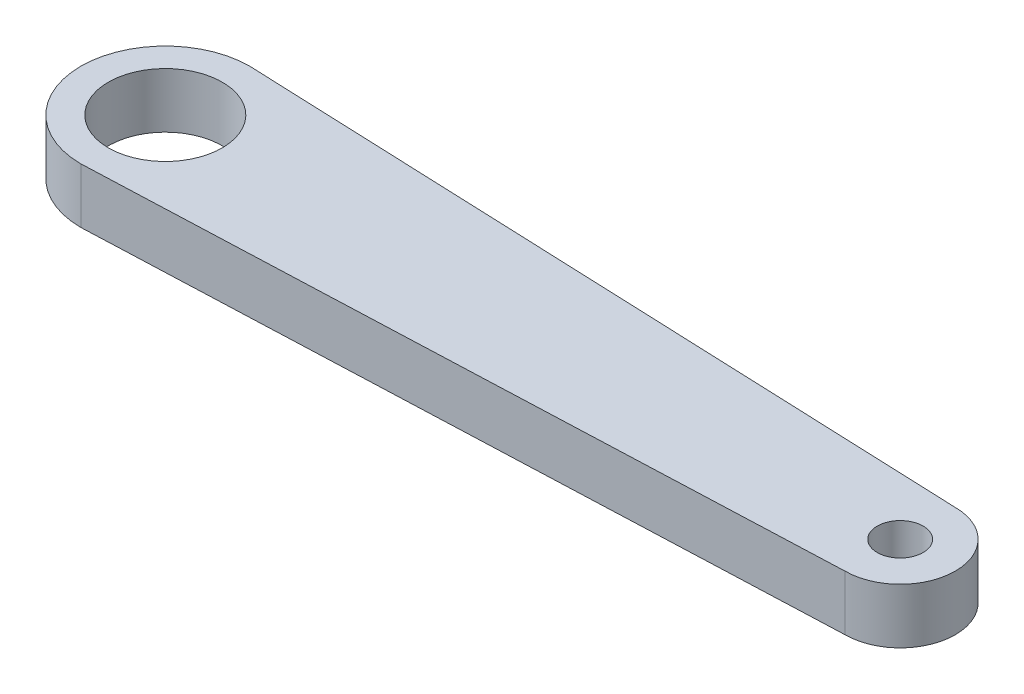
ISO-10303-21;
HEADER;
FILE_DESCRIPTION(('STEP AP214'),'2;1');
FILE_NAME('part.step','',(''),(''),'','','');
FILE_SCHEMA(('AUTOMOTIVE_DESIGN { 1 0 10303 214 1 1 1 1 }'));
ENDSEC;
DATA;
#1=APPLICATION_CONTEXT('core data for automotive mechanical design processes');
#2=APPLICATION_PROTOCOL_DEFINITION('international standard','automotive_design',2000,#1);
#3=PRODUCT_CONTEXT('',#1,'mechanical');
#4=PRODUCT('Part','Part','',(#3));
#5=PRODUCT_RELATED_PRODUCT_CATEGORY('part','',(#4));
#6=PRODUCT_DEFINITION_FORMATION('','',#4);
#7=PRODUCT_DEFINITION_CONTEXT('part definition',#1,'design');
#8=PRODUCT_DEFINITION('design','',#6,#7);
#9=PRODUCT_DEFINITION_SHAPE('','',#8);
#10=(LENGTH_UNIT() NAMED_UNIT(*) SI_UNIT(.MILLI.,.METRE.));
#11=(NAMED_UNIT(*) PLANE_ANGLE_UNIT() SI_UNIT($,.RADIAN.));
#12=(NAMED_UNIT(*) SI_UNIT($,.STERADIAN.) SOLID_ANGLE_UNIT());
#13=UNCERTAINTY_MEASURE_WITH_UNIT(LENGTH_MEASURE(1.E-05),#10,'distance_accuracy_value','');
#14=(GEOMETRIC_REPRESENTATION_CONTEXT(3) GLOBAL_UNCERTAINTY_ASSIGNED_CONTEXT((#13)) GLOBAL_UNIT_ASSIGNED_CONTEXT((#10,
#11,#12)) REPRESENTATION_CONTEXT('',''));
#15=CARTESIAN_POINT('',(0.,0.,0.));
#16=DIRECTION('',(0.,0.,1.));
#17=DIRECTION('',(1.,0.,0.));
#18=AXIS2_PLACEMENT_3D('',#15,#16,#17);
#19=CARTESIAN_POINT('',(0.18370607028754,3.,4.5926517571885));
#20=DIRECTION('',(0.0399680383488716,0.,0.999200958721789));
#21=DIRECTION('',(0.99920095872179,0.,-0.0399680383488716));
#22=AXIS2_PLACEMENT_3D('',#19,#20,#21);
#23=PLANE('',#22);
#24=DIRECTION('',(-0.99920095872179,0.,0.0399680383488716));
#25=VECTOR('',#24,1.);
#26=CARTESIAN_POINT('',(0.18370607028754,0.,4.5926517571885));
#27=LINE('',#26,#25);
#28=CARTESIAN_POINT('',(40.,0.,3.));
#29=VERTEX_POINT('',#28);
#30=CARTESIAN_POINT('',(0.,0.,4.6));
#31=VERTEX_POINT('',#30);
#32=EDGE_CURVE('E122',#29,#31,#27,.T.);
#33=ORIENTED_EDGE('',*,*,#32,.F.);
#34=DIRECTION('',(0.,-1.,0.));
#35=VECTOR('',#34,1.);
#36=CARTESIAN_POINT('',(40.,3.,3.));
#37=LINE('',#36,#35);
#38=CARTESIAN_POINT('',(40.,3.,3.));
#39=VERTEX_POINT('',#38);
#40=EDGE_CURVE('E11',#39,#29,#37,.T.);
#41=ORIENTED_EDGE('',*,*,#40,.F.);
#42=DIRECTION('',(-0.99920095872179,0.,0.0399680383488716));
#43=VECTOR('',#42,1.);
#44=CARTESIAN_POINT('',(0.18370607028754,3.,4.5926517571885));
#45=LINE('',#44,#43);
#46=CARTESIAN_POINT('',(0.,3.,4.6));
#47=VERTEX_POINT('',#46);
#48=EDGE_CURVE('E95',#39,#47,#45,.T.);
#49=ORIENTED_EDGE('',*,*,#48,.T.);
#50=DIRECTION('',(0.,-1.,0.));
#51=VECTOR('',#50,1.);
#52=CARTESIAN_POINT('',(0.,3.,4.6));
#53=LINE('',#52,#51);
#54=EDGE_CURVE('E84',#47,#31,#53,.T.);
#55=ORIENTED_EDGE('',*,*,#54,.T.);
#56=EDGE_LOOP('',(#33,#41,#49,#55));
#57=FACE_BOUND('',#56,.T.);
#58=ADVANCED_FACE('F45',(#57),#23,.T.);
#59=CARTESIAN_POINT('',(40.,3.,0.));
#60=DIRECTION('',(0.,-1.,0.));
#61=DIRECTION('',(0.,0.,-1.));
#62=AXIS2_PLACEMENT_3D('',#59,#60,#61);
#63=CYLINDRICAL_SURFACE('',#62,3.);
#64=CARTESIAN_POINT('',(40.,0.,0.));
#65=DIRECTION('',(0.,1.,0.));
#66=DIRECTION('',(0.,0.,1.));
#67=AXIS2_PLACEMENT_3D('',#64,#65,#66);
#68=CIRCLE('',#67,3.);
#69=CARTESIAN_POINT('',(40.,0.,-3.));
#70=VERTEX_POINT('',#69);
#71=EDGE_CURVE('E102',#29,#70,#68,.T.);
#72=ORIENTED_EDGE('',*,*,#71,.T.);
#73=DIRECTION('',(0.,-1.,0.));
#74=VECTOR('',#73,1.);
#75=CARTESIAN_POINT('',(40.,3.,-3.));
#76=LINE('',#75,#74);
#77=CARTESIAN_POINT('',(40.,3.,-3.));
#78=VERTEX_POINT('',#77);
#79=EDGE_CURVE('E54',#78,#70,#76,.T.);
#80=ORIENTED_EDGE('',*,*,#79,.F.);
#81=CARTESIAN_POINT('',(40.,3.,0.));
#82=DIRECTION('',(0.,1.,0.));
#83=DIRECTION('',(0.,0.,1.));
#84=AXIS2_PLACEMENT_3D('',#81,#82,#83);
#85=CIRCLE('',#84,3.);
#86=EDGE_CURVE('E89',#39,#78,#85,.T.);
#87=ORIENTED_EDGE('',*,*,#86,.F.);
#88=ORIENTED_EDGE('',*,*,#40,.T.);
#89=EDGE_LOOP('',(#72,#80,#87,#88));
#90=FACE_BOUND('',#89,.T.);
#91=ADVANCED_FACE('F100',(#90),#63,.T.);
#92=CARTESIAN_POINT('',(0.18370607028754,3.,-4.5926517571885));
#93=DIRECTION('',(0.0399680383488716,0.,-0.999200958721789));
#94=DIRECTION('',(-0.99920095872179,0.,-0.0399680383488716));
#95=AXIS2_PLACEMENT_3D('',#92,#93,#94);
#96=PLANE('',#95);
#97=DIRECTION('',(0.99920095872179,0.,0.0399680383488716));
#98=VECTOR('',#97,1.);
#99=CARTESIAN_POINT('',(0.18370607028754,0.,-4.5926517571885));
#100=LINE('',#99,#98);
#101=CARTESIAN_POINT('',(0.,0.,-4.6));
#102=VERTEX_POINT('',#101);
#103=EDGE_CURVE('E128',#102,#70,#100,.T.);
#104=ORIENTED_EDGE('',*,*,#103,.F.);
#105=DIRECTION('',(0.,-1.,0.));
#106=VECTOR('',#105,1.);
#107=CARTESIAN_POINT('',(0.,3.,-4.6));
#108=LINE('',#107,#106);
#109=CARTESIAN_POINT('',(0.,3.,-4.6));
#110=VERTEX_POINT('',#109);
#111=EDGE_CURVE('E77',#110,#102,#108,.T.);
#112=ORIENTED_EDGE('',*,*,#111,.F.);
#113=DIRECTION('',(0.99920095872179,0.,0.0399680383488716));
#114=VECTOR('',#113,1.);
#115=CARTESIAN_POINT('',(0.18370607028754,3.,-4.5926517571885));
#116=LINE('',#115,#114);
#117=EDGE_CURVE('E94',#110,#78,#116,.T.);
#118=ORIENTED_EDGE('',*,*,#117,.T.);
#119=ORIENTED_EDGE('',*,*,#79,.T.);
#120=EDGE_LOOP('',(#104,#112,#118,#119));
#121=FACE_BOUND('',#120,.T.);
#122=ADVANCED_FACE('F107',(#121),#96,.T.);
#123=CARTESIAN_POINT('',(0.,3.,0.));
#124=DIRECTION('',(0.,-1.,0.));
#125=DIRECTION('',(0.,0.,-1.));
#126=AXIS2_PLACEMENT_3D('',#123,#124,#125);
#127=CYLINDRICAL_SURFACE('',#126,3.1);
#128=CARTESIAN_POINT('',(0.,3.,0.));
#129=DIRECTION('',(0.,1.,0.));
#130=DIRECTION('',(0.,0.,1.));
#131=AXIS2_PLACEMENT_3D('',#128,#129,#130);
#132=CIRCLE('',#131,3.1);
#133=CARTESIAN_POINT('',(0.,3.,3.1));
#134=VERTEX_POINT('',#133);
#135=EDGE_CURVE('E111',#134,#134,#132,.T.);
#136=ORIENTED_EDGE('',*,*,#135,.T.);
#137=EDGE_LOOP('',(#136));
#138=FACE_BOUND('',#137,.T.);
#139=CARTESIAN_POINT('',(0.,0.,0.));
#140=DIRECTION('',(0.,1.,0.));
#141=DIRECTION('',(0.,0.,1.));
#142=AXIS2_PLACEMENT_3D('',#139,#140,#141);
#143=CIRCLE('',#142,3.1);
#144=CARTESIAN_POINT('',(0.,0.,3.1));
#145=VERTEX_POINT('',#144);
#146=EDGE_CURVE('E134',#145,#145,#143,.T.);
#147=ORIENTED_EDGE('',*,*,#146,.F.);
#148=EDGE_LOOP('',(#147));
#149=FACE_BOUND('',#148,.T.);
#150=ADVANCED_FACE('F155',(#138,#149),#127,.F.);
#151=CARTESIAN_POINT('',(0.,3.,0.));
#152=DIRECTION('',(0.,-1.,0.));
#153=DIRECTION('',(0.,0.,-1.));
#154=AXIS2_PLACEMENT_3D('',#151,#152,#153);
#155=CYLINDRICAL_SURFACE('',#154,4.6);
#156=CARTESIAN_POINT('',(0.,0.,0.));
#157=DIRECTION('',(0.,1.,0.));
#158=DIRECTION('',(0.,0.,1.));
#159=AXIS2_PLACEMENT_3D('',#156,#157,#158);
#160=CIRCLE('',#159,4.6);
#161=EDGE_CURVE('E131',#102,#31,#160,.T.);
#162=ORIENTED_EDGE('',*,*,#161,.T.);
#163=ORIENTED_EDGE('',*,*,#54,.F.);
#164=CARTESIAN_POINT('',(0.,3.,0.));
#165=DIRECTION('',(0.,1.,0.));
#166=DIRECTION('',(0.,0.,1.));
#167=AXIS2_PLACEMENT_3D('',#164,#165,#166);
#168=CIRCLE('',#167,4.6);
#169=EDGE_CURVE('E62',#110,#47,#168,.T.);
#170=ORIENTED_EDGE('',*,*,#169,.F.);
#171=ORIENTED_EDGE('',*,*,#111,.T.);
#172=EDGE_LOOP('',(#162,#163,#170,#171));
#173=FACE_BOUND('',#172,.T.);
#174=ADVANCED_FACE('F158',(#173),#155,.T.);
#175=CARTESIAN_POINT('',(40.,3.,0.));
#176=DIRECTION('',(0.,-1.,0.));
#177=DIRECTION('',(0.,0.,-1.));
#178=AXIS2_PLACEMENT_3D('',#175,#176,#177);
#179=CYLINDRICAL_SURFACE('',#178,1.25);
#180=CARTESIAN_POINT('',(40.,3.,0.));
#181=DIRECTION('',(0.,1.,0.));
#182=DIRECTION('',(0.,0.,1.));
#183=AXIS2_PLACEMENT_3D('',#180,#181,#182);
#184=CIRCLE('',#183,1.25);
#185=CARTESIAN_POINT('',(40.,3.,1.25));
#186=VERTEX_POINT('',#185);
#187=EDGE_CURVE('E118',#186,#186,#184,.T.);
#188=ORIENTED_EDGE('',*,*,#187,.T.);
#189=EDGE_LOOP('',(#188));
#190=FACE_BOUND('',#189,.T.);
#191=CARTESIAN_POINT('',(40.,0.,0.));
#192=DIRECTION('',(0.,1.,0.));
#193=DIRECTION('',(0.,0.,1.));
#194=AXIS2_PLACEMENT_3D('',#191,#192,#193);
#195=CIRCLE('',#194,1.25);
#196=CARTESIAN_POINT('',(40.,0.,1.25));
#197=VERTEX_POINT('',#196);
#198=EDGE_CURVE('E138',#197,#197,#195,.T.);
#199=ORIENTED_EDGE('',*,*,#198,.F.);
#200=EDGE_LOOP('',(#199));
#201=FACE_BOUND('',#200,.T.);
#202=ADVANCED_FACE('F161',(#190,#201),#179,.F.);
#203=CARTESIAN_POINT('',(0.,3.,0.));
#204=DIRECTION('',(0.,1.,0.));
#205=DIRECTION('',(0.,0.,1.));
#206=AXIS2_PLACEMENT_3D('',#203,#204,#205);
#207=PLANE('',#206);
#208=ORIENTED_EDGE('',*,*,#48,.F.);
#209=ORIENTED_EDGE('',*,*,#86,.T.);
#210=ORIENTED_EDGE('',*,*,#117,.F.);
#211=ORIENTED_EDGE('',*,*,#169,.T.);
#212=EDGE_LOOP('',(#208,#209,#210,#211));
#213=FACE_BOUND('',#212,.T.);
#214=ORIENTED_EDGE('',*,*,#135,.F.);
#215=EDGE_LOOP('',(#214));
#216=FACE_BOUND('',#215,.T.);
#217=ORIENTED_EDGE('',*,*,#187,.F.);
#218=EDGE_LOOP('',(#217));
#219=FACE_BOUND('',#218,.T.);
#220=ADVANCED_FACE('F91',(#213,#216,#219),#207,.T.);
#221=CARTESIAN_POINT('',(0.,0.,0.));
#222=DIRECTION('',(0.,1.,0.));
#223=DIRECTION('',(0.,0.,1.));
#224=AXIS2_PLACEMENT_3D('',#221,#222,#223);
#225=PLANE('',#224);
#226=ORIENTED_EDGE('',*,*,#32,.T.);
#227=ORIENTED_EDGE('',*,*,#161,.F.);
#228=ORIENTED_EDGE('',*,*,#103,.T.);
#229=ORIENTED_EDGE('',*,*,#71,.F.);
#230=EDGE_LOOP('',(#226,#227,#228,#229));
#231=FACE_BOUND('',#230,.T.);
#232=ORIENTED_EDGE('',*,*,#146,.T.);
#233=EDGE_LOOP('',(#232));
#234=FACE_BOUND('',#233,.T.);
#235=ORIENTED_EDGE('',*,*,#198,.T.);
#236=EDGE_LOOP('',(#235));
#237=FACE_BOUND('',#236,.T.);
#238=ADVANCED_FACE('F168',(#231,#234,#237),#225,.F.);
#239=CLOSED_SHELL('',(#58,#91,#122,#150,#174,#202,#220,#238));
#240=MANIFOLD_SOLID_BREP('B2',#239);
#241=ADVANCED_BREP_SHAPE_REPRESENTATION('',(#18,#240),#14);
#242=SHAPE_DEFINITION_REPRESENTATION(#9,#241);
ENDSEC;
END-ISO-10303-21;
